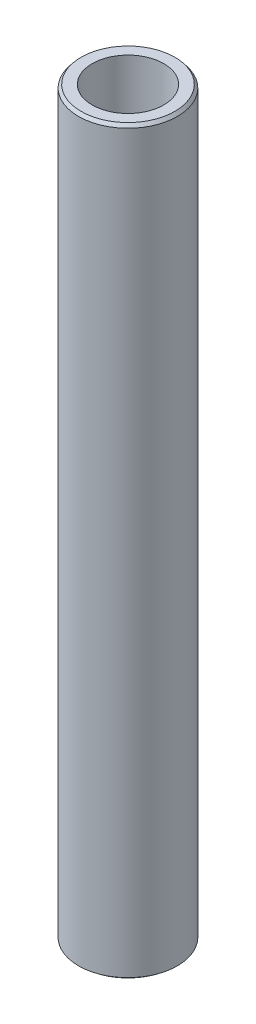
ISO-10303-21;
HEADER;
FILE_DESCRIPTION(('STEP AP214'),'2;1');
FILE_NAME('part.step','',(''),(''),'','','');
FILE_SCHEMA(('AUTOMOTIVE_DESIGN { 1 0 10303 214 1 1 1 1 }'));
ENDSEC;
DATA;
#1=APPLICATION_CONTEXT('core data for automotive mechanical design processes');
#2=APPLICATION_PROTOCOL_DEFINITION('international standard','automotive_design',2000,#1);
#3=PRODUCT_CONTEXT('',#1,'mechanical');
#4=PRODUCT('Part','Part','',(#3));
#5=PRODUCT_RELATED_PRODUCT_CATEGORY('part','',(#4));
#6=PRODUCT_DEFINITION_FORMATION('','',#4);
#7=PRODUCT_DEFINITION_CONTEXT('part definition',#1,'design');
#8=PRODUCT_DEFINITION('design','',#6,#7);
#9=PRODUCT_DEFINITION_SHAPE('','',#8);
#10=(LENGTH_UNIT() NAMED_UNIT(*) SI_UNIT(.MILLI.,.METRE.));
#11=(NAMED_UNIT(*) PLANE_ANGLE_UNIT() SI_UNIT($,.RADIAN.));
#12=(NAMED_UNIT(*) SI_UNIT($,.STERADIAN.) SOLID_ANGLE_UNIT());
#13=UNCERTAINTY_MEASURE_WITH_UNIT(LENGTH_MEASURE(1.E-05),#10,'distance_accuracy_value','');
#14=(GEOMETRIC_REPRESENTATION_CONTEXT(3) GLOBAL_UNCERTAINTY_ASSIGNED_CONTEXT((#13)) GLOBAL_UNIT_ASSIGNED_CONTEXT((#10,
#11,#12)) REPRESENTATION_CONTEXT('',''));
#15=CARTESIAN_POINT('',(0.,0.,0.));
#16=DIRECTION('',(0.,0.,1.));
#17=DIRECTION('',(1.,0.,0.));
#18=AXIS2_PLACEMENT_3D('',#15,#16,#17);
#19=CARTESIAN_POINT('',(0.,600.,0.));
#20=DIRECTION('',(0.,-1.,0.));
#21=DIRECTION('',(0.,0.,-1.));
#22=AXIS2_PLACEMENT_3D('',#19,#20,#21);
#23=CYLINDRICAL_SURFACE('',#22,40.);
#24=CARTESIAN_POINT('',(0.,597.448909840936,0.));
#25=DIRECTION('',(0.,1.,0.));
#26=DIRECTION('',(0.,0.,1.));
#27=AXIS2_PLACEMENT_3D('',#24,#25,#26);
#28=CIRCLE('',#27,40.);
#29=CARTESIAN_POINT('',(0.,597.448909840936,40.));
#30=VERTEX_POINT('',#29);
#31=EDGE_CURVE('E50',#30,#30,#28,.F.);
#32=ORIENTED_EDGE('',*,*,#31,.T.);
#33=EDGE_LOOP('',(#32));
#34=FACE_BOUND('',#33,.T.);
#35=CARTESIAN_POINT('',(0.,2.03075748942283,0.));
#36=DIRECTION('',(0.,1.,0.));
#37=DIRECTION('',(0.,0.,1.));
#38=AXIS2_PLACEMENT_3D('',#35,#36,#37);
#39=CIRCLE('',#38,40.);
#40=CARTESIAN_POINT('',(0.,2.03075748942283,40.));
#41=VERTEX_POINT('',#40);
#42=EDGE_CURVE('E51',#41,#41,#39,.T.);
#43=ORIENTED_EDGE('',*,*,#42,.T.);
#44=EDGE_LOOP('',(#43));
#45=FACE_BOUND('',#44,.T.);
#46=ADVANCED_FACE('F39',(#34,#45),#23,.T.);
#47=CARTESIAN_POINT('',(0.,600.,0.));
#48=DIRECTION('',(0.,1.,0.));
#49=DIRECTION('',(0.,0.,1.));
#50=AXIS2_PLACEMENT_3D('',#47,#48,#49);
#51=PLANE('',#50);
#52=CARTESIAN_POINT('',(0.,600.,0.));
#53=DIRECTION('',(0.,1.,0.));
#54=DIRECTION('',(0.,0.,1.));
#55=AXIS2_PLACEMENT_3D('',#52,#53,#54);
#56=CIRCLE('',#55,37.9692425105771);
#57=CARTESIAN_POINT('',(0.,600.,37.9692425105771));
#58=VERTEX_POINT('',#57);
#59=EDGE_CURVE('E54',#58,#58,#56,.T.);
#60=ORIENTED_EDGE('',*,*,#59,.T.);
#61=EDGE_LOOP('',(#60));
#62=FACE_BOUND('',#61,.T.);
#63=CARTESIAN_POINT('',(0.,600.,0.));
#64=DIRECTION('',(0.,1.,0.));
#65=DIRECTION('',(0.,0.,1.));
#66=AXIS2_PLACEMENT_3D('',#63,#64,#65);
#67=CIRCLE('',#66,28.9978381779837);
#68=CARTESIAN_POINT('',(0.,600.,28.9978381779837));
#69=VERTEX_POINT('',#68);
#70=EDGE_CURVE('E58',#69,#69,#67,.T.);
#71=ORIENTED_EDGE('',*,*,#70,.F.);
#72=EDGE_LOOP('',(#71));
#73=FACE_BOUND('',#72,.T.);
#74=ADVANCED_FACE('F69',(#62,#73),#51,.T.);
#75=CARTESIAN_POINT('',(0.,0.,0.));
#76=DIRECTION('',(0.,1.,0.));
#77=DIRECTION('',(0.,0.,1.));
#78=AXIS2_PLACEMENT_3D('',#75,#76,#77);
#79=PLANE('',#78);
#80=CARTESIAN_POINT('',(0.,0.,0.));
#81=DIRECTION('',(0.,1.,0.));
#82=DIRECTION('',(0.,0.,1.));
#83=AXIS2_PLACEMENT_3D('',#80,#81,#82);
#84=CIRCLE('',#83,37.4489098409364);
#85=CARTESIAN_POINT('',(0.,0.,37.4489098409364));
#86=VERTEX_POINT('',#85);
#87=EDGE_CURVE('E10',#86,#86,#84,.F.);
#88=ORIENTED_EDGE('',*,*,#87,.T.);
#89=EDGE_LOOP('',(#88));
#90=FACE_BOUND('',#89,.T.);
#91=CARTESIAN_POINT('',(0.,0.,0.));
#92=DIRECTION('',(0.,1.,0.));
#93=DIRECTION('',(0.,0.,1.));
#94=AXIS2_PLACEMENT_3D('',#91,#92,#93);
#95=CIRCLE('',#94,28.9978381779837);
#96=CARTESIAN_POINT('',(0.,0.,28.9978381779837));
#97=VERTEX_POINT('',#96);
#98=EDGE_CURVE('E63',#97,#97,#95,.T.);
#99=ORIENTED_EDGE('',*,*,#98,.T.);
#100=EDGE_LOOP('',(#99));
#101=FACE_BOUND('',#100,.T.);
#102=ADVANCED_FACE('F75',(#90,#101),#79,.F.);
#103=CARTESIAN_POINT('',(0.,600.,0.));
#104=DIRECTION('',(0.,-1.,0.));
#105=DIRECTION('',(0.,0.,-1.));
#106=AXIS2_PLACEMENT_3D('',#103,#104,#105);
#107=CYLINDRICAL_SURFACE('',#106,28.9978381779837);
#108=ORIENTED_EDGE('',*,*,#70,.T.);
#109=EDGE_LOOP('',(#108));
#110=FACE_BOUND('',#109,.T.);
#111=ORIENTED_EDGE('',*,*,#98,.F.);
#112=EDGE_LOOP('',(#111));
#113=FACE_BOUND('',#112,.T.);
#114=ADVANCED_FACE('F70',(#110,#113),#107,.F.);
#115=CARTESIAN_POINT('',(0.,600.,0.));
#116=DIRECTION('',(0.,-1.,0.));
#117=DIRECTION('',(0.,0.,-1.));
#118=AXIS2_PLACEMENT_3D('',#115,#116,#117);
#119=CONICAL_SURFACE('',#118,37.9692425105771,0.672318683112409);
#120=ORIENTED_EDGE('',*,*,#31,.F.);
#121=EDGE_LOOP('',(#120));
#122=FACE_BOUND('',#121,.T.);
#123=ORIENTED_EDGE('',*,*,#59,.F.);
#124=EDGE_LOOP('',(#123));
#125=FACE_BOUND('',#124,.T.);
#126=ADVANCED_FACE('F81',(#122,#125),#119,.T.);
#127=CARTESIAN_POINT('',(0.,2.03075748942283,0.));
#128=DIRECTION('',(0.,1.,0.));
#129=DIRECTION('',(0.,0.,1.));
#130=AXIS2_PLACEMENT_3D('',#127,#128,#129);
#131=CONICAL_SURFACE('',#130,40.,0.898477643682468);
#132=ORIENTED_EDGE('',*,*,#87,.F.);
#133=EDGE_LOOP('',(#132));
#134=FACE_BOUND('',#133,.T.);
#135=ORIENTED_EDGE('',*,*,#42,.F.);
#136=EDGE_LOOP('',(#135));
#137=FACE_BOUND('',#136,.T.);
#138=ADVANCED_FACE('F45',(#134,#137),#131,.T.);
#139=CLOSED_SHELL('',(#46,#74,#102,#114,#126,#138));
#140=MANIFOLD_SOLID_BREP('B2',#139);
#141=ADVANCED_BREP_SHAPE_REPRESENTATION('',(#18,#140),#14);
#142=SHAPE_DEFINITION_REPRESENTATION(#9,#141);
ENDSEC;
END-ISO-10303-21;
